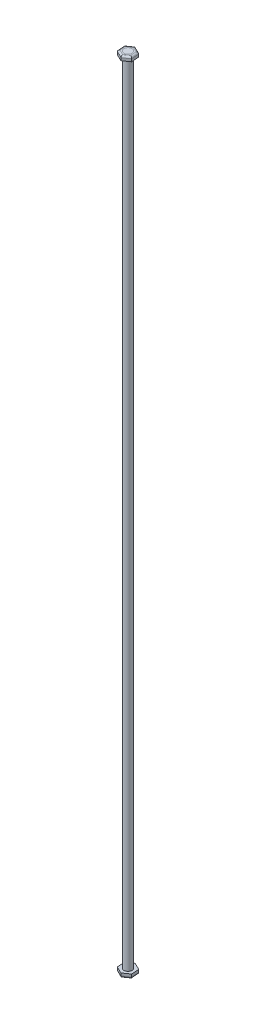
ISO-10303-21;
HEADER;
FILE_DESCRIPTION(('STEP AP214'),'2;1');
FILE_NAME('part.step','',(''),(''),'','','');
FILE_SCHEMA(('AUTOMOTIVE_DESIGN { 1 0 10303 214 1 1 1 1 }'));
ENDSEC;
DATA;
#1=APPLICATION_CONTEXT('core data for automotive mechanical design processes');
#2=APPLICATION_PROTOCOL_DEFINITION('international standard','automotive_design',2000,#1);
#3=PRODUCT_CONTEXT('',#1,'mechanical');
#4=PRODUCT('Part','Part','',(#3));
#5=PRODUCT_RELATED_PRODUCT_CATEGORY('part','',(#4));
#6=PRODUCT_DEFINITION_FORMATION('','',#4);
#7=PRODUCT_DEFINITION_CONTEXT('part definition',#1,'design');
#8=PRODUCT_DEFINITION('design','',#6,#7);
#9=PRODUCT_DEFINITION_SHAPE('','',#8);
#10=(LENGTH_UNIT() NAMED_UNIT(*) SI_UNIT(.MILLI.,.METRE.));
#11=(NAMED_UNIT(*) PLANE_ANGLE_UNIT() SI_UNIT($,.RADIAN.));
#12=(NAMED_UNIT(*) SI_UNIT($,.STERADIAN.) SOLID_ANGLE_UNIT());
#13=UNCERTAINTY_MEASURE_WITH_UNIT(LENGTH_MEASURE(1.E-05),#10,'distance_accuracy_value','');
#14=(GEOMETRIC_REPRESENTATION_CONTEXT(3) GLOBAL_UNCERTAINTY_ASSIGNED_CONTEXT((#13)) GLOBAL_UNIT_ASSIGNED_CONTEXT((#10,
#11,#12)) REPRESENTATION_CONTEXT('',''));
#15=CARTESIAN_POINT('',(0.,0.,0.));
#16=DIRECTION('',(0.,0.,1.));
#17=DIRECTION('',(1.,0.,0.));
#18=AXIS2_PLACEMENT_3D('',#15,#16,#17);
#19=CARTESIAN_POINT('',(0.,236.855,0.));
#20=DIRECTION('',(0.,1.,0.));
#21=DIRECTION('',(0.,0.,1.));
#22=AXIS2_PLACEMENT_3D('',#19,#20,#21);
#23=PLANE('',#22);
#24=CARTESIAN_POINT('',(0.,236.855,0.));
#25=DIRECTION('',(0.,1.,0.));
#26=DIRECTION('',(0.,0.,1.));
#27=AXIS2_PLACEMENT_3D('',#24,#25,#26);
#28=CIRCLE('',#27,2.38125);
#29=CARTESIAN_POINT('',(0.,236.855,2.38125));
#30=VERTEX_POINT('',#29);
#31=EDGE_CURVE('P0_E115',#30,#30,#28,.F.);
#32=ORIENTED_EDGE('',*,*,#31,.T.);
#33=EDGE_LOOP('',(#32));
#34=FACE_BOUND('',#33,.T.);
#35=DIRECTION('',(0.0820841913920924,0.,0.996625398795107));
#36=VECTOR('',#35,1.);
#37=CARTESIAN_POINT('',(-2.95873165267297,236.855,0.243687443195274));
#38=LINE('',#37,#36);
#39=CARTESIAN_POINT('',(-2.81803864174605,236.855,1.95191195932588));
#40=VERTEX_POINT('',#39);
#41=CARTESIAN_POINT('',(-3.0994246635999,236.855,-1.46453707293534));
#42=VERTEX_POINT('',#41);
#43=EDGE_CURVE('P0_E103',#40,#42,#38,.F.);
#44=ORIENTED_EDGE('',*,*,#43,.F.);
#45=DIRECTION('',(0.904145009109406,0.,0.427225704402898));
#46=VECTOR('',#45,1.);
#47=CARTESIAN_POINT('',(-1.2683263099461,236.855,2.68418049579355));
#48=LINE('',#47,#46);
#49=CARTESIAN_POINT('',(0.281386021853847,236.855,3.41644903226122));
#50=VERTEX_POINT('',#49);
#51=EDGE_CURVE('P0_E144',#50,#40,#48,.F.);
#52=ORIENTED_EDGE('',*,*,#51,.F.);
#53=DIRECTION('',(0.822060817717314,0.,-0.569399694392209));
#54=VECTOR('',#53,1.);
#55=CARTESIAN_POINT('',(1.69040534272687,236.855,2.44049305259828));
#56=LINE('',#55,#54);
#57=CARTESIAN_POINT('',(3.0994246635999,236.855,1.46453707293534));
#58=VERTEX_POINT('',#57);
#59=EDGE_CURVE('P0_E140',#58,#50,#56,.F.);
#60=ORIENTED_EDGE('',*,*,#59,.F.);
#61=DIRECTION('',(-0.082084191392092,0.,-0.996625398795107));
#62=VECTOR('',#61,1.);
#63=CARTESIAN_POINT('',(2.95873165267297,236.855,-0.243687443195273));
#64=LINE('',#63,#62);
#65=CARTESIAN_POINT('',(2.81803864174605,236.855,-1.95191195932588));
#66=VERTEX_POINT('',#65);
#67=EDGE_CURVE('P0_E91',#66,#58,#64,.F.);
#68=ORIENTED_EDGE('',*,*,#67,.F.);
#69=DIRECTION('',(-0.904145009109406,0.,-0.427225704402898));
#70=VECTOR('',#69,1.);
#71=CARTESIAN_POINT('',(1.2683263099461,236.855,-2.68418049579355));
#72=LINE('',#71,#70);
#73=CARTESIAN_POINT('',(-0.281386021853847,236.855,-3.41644903226122));
#74=VERTEX_POINT('',#73);
#75=EDGE_CURVE('P0_E85',#74,#66,#72,.F.);
#76=ORIENTED_EDGE('',*,*,#75,.F.);
#77=DIRECTION('',(-0.822060817717314,0.,0.56939969439221));
#78=VECTOR('',#77,1.);
#79=CARTESIAN_POINT('',(-1.69040534272687,236.855,-2.44049305259828));
#80=LINE('',#79,#78);
#81=EDGE_CURVE('P0_E88',#42,#74,#80,.F.);
#82=ORIENTED_EDGE('',*,*,#81,.F.);
#83=EDGE_LOOP('',(#44,#52,#60,#68,#76,#82));
#84=FACE_BOUND('',#83,.T.);
#85=ADVANCED_FACE('P0_F17',(#34,#84),#23,.T.);
#86=CARTESIAN_POINT('',(1.2683263099461,235.855,-2.68418049579355));
#87=DIRECTION('',(-0.904145009109406,0.,-0.427225704402898));
#88=DIRECTION('',(-0.427225704402898,0.,0.904145009109406));
#89=AXIS2_PLACEMENT_3D('',#86,#87,#88);
#90=CYLINDRICAL_SURFACE('',#89,1.);
#91=CARTESIAN_POINT('',(-0.281386021853847,235.855,-3.41644903226122));
#92=DIRECTION('',(-0.996625398795107,0.,0.0820841913920922));
#93=DIRECTION('',(0.0820841913920922,0.,0.996625398795107));
#94=AXIS2_PLACEMENT_3D('',#91,#92,#93);
#95=ELLIPSE('',#94,1.15470053837925,1.);
#96=CARTESIAN_POINT('',(-0.376168681846721,235.855,-4.56725291681236));
#97=VERTEX_POINT('',#96);
#98=EDGE_CURVE('P0_E20',#74,#97,#95,.T.);
#99=ORIENTED_EDGE('',*,*,#98,.F.);
#100=ORIENTED_EDGE('',*,*,#75,.T.);
#101=CARTESIAN_POINT('',(2.81803864174605,235.855,-1.95191195932588));
#102=DIRECTION('',(-0.569399694392209,0.,-0.822060817717314));
#103=DIRECTION('',(0.822060817717314,0.,-0.569399694392209));
#104=AXIS2_PLACEMENT_3D('',#101,#102,#103);
#105=ELLIPSE('',#104,1.15470053837925,1.);
#106=CARTESIAN_POINT('',(3.76727271054472,235.855,-2.60939809299355));
#107=VERTEX_POINT('',#106);
#108=EDGE_CURVE('P0_E109',#107,#66,#105,.F.);
#109=ORIENTED_EDGE('',*,*,#108,.F.);
#110=DIRECTION('',(-0.904145009109406,0.,-0.427225704402898));
#111=VECTOR('',#110,1.);
#112=CARTESIAN_POINT('',(3.76727271054472,235.855,-2.60939809299355));
#113=LINE('',#112,#111);
#114=EDGE_CURVE('P0_E107',#97,#107,#113,.F.);
#115=ORIENTED_EDGE('',*,*,#114,.F.);
#116=EDGE_LOOP('',(#99,#100,#109,#115));
#117=FACE_BOUND('',#116,.T.);
#118=ADVANCED_FACE('P0_F106',(#117),#90,.T.);
#119=CARTESIAN_POINT('',(-1.69040534272687,235.855,-2.44049305259828));
#120=DIRECTION('',(-0.822060817717314,0.,0.56939969439221));
#121=DIRECTION('',(0.56939969439221,0.,0.822060817717314));
#122=AXIS2_PLACEMENT_3D('',#119,#120,#121);
#123=CYLINDRICAL_SURFACE('',#122,1.);
#124=CARTESIAN_POINT('',(-3.0994246635999,235.855,-1.46453707293534));
#125=DIRECTION('',(-0.427225704402898,0.,0.904145009109406));
#126=DIRECTION('',(0.904145009109406,0.,0.427225704402898));
#127=AXIS2_PLACEMENT_3D('',#124,#125,#126);
#128=ELLIPSE('',#127,1.15470053837925,1.);
#129=CARTESIAN_POINT('',(-4.14344139239144,235.855,-1.95785482381882));
#130=VERTEX_POINT('',#129);
#131=EDGE_CURVE('P0_E102',#42,#130,#128,.T.);
#132=ORIENTED_EDGE('',*,*,#131,.F.);
#133=ORIENTED_EDGE('',*,*,#81,.T.);
#134=ORIENTED_EDGE('',*,*,#98,.T.);
#135=DIRECTION('',(-0.822060817717314,0.,0.56939969439221));
#136=VECTOR('',#135,1.);
#137=CARTESIAN_POINT('',(-0.376168681846721,235.855,-4.56725291681236));
#138=LINE('',#137,#136);
#139=EDGE_CURVE('P0_E114',#130,#97,#138,.F.);
#140=ORIENTED_EDGE('',*,*,#139,.F.);
#141=EDGE_LOOP('',(#132,#133,#134,#140));
#142=FACE_BOUND('',#141,.T.);
#143=ADVANCED_FACE('P0_F99',(#142),#123,.T.);
#144=CARTESIAN_POINT('',(-2.95873165267297,235.855,0.243687443195274));
#145=DIRECTION('',(0.0820841913920924,0.,0.996625398795107));
#146=DIRECTION('',(0.996625398795107,0.,-0.0820841913920924));
#147=AXIS2_PLACEMENT_3D('',#144,#145,#146);
#148=CYLINDRICAL_SURFACE('',#147,1.);
#149=ORIENTED_EDGE('',*,*,#131,.T.);
#150=DIRECTION('',(0.0820841913920924,0.,0.996625398795107));
#151=VECTOR('',#150,1.);
#152=CARTESIAN_POINT('',(-4.14344139239144,235.855,-1.95785482381882));
#153=LINE('',#152,#151);
#154=CARTESIAN_POINT('',(-3.76727271054472,235.855,2.60939809299355));
#155=VERTEX_POINT('',#154);
#156=EDGE_CURVE('P0_E124',#155,#130,#153,.F.);
#157=ORIENTED_EDGE('',*,*,#156,.F.);
#158=CARTESIAN_POINT('',(-2.81803864174605,235.855,1.95191195932588));
#159=DIRECTION('',(0.569399694392209,0.,0.822060817717314));
#160=DIRECTION('',(0.822060817717314,0.,-0.569399694392209));
#161=AXIS2_PLACEMENT_3D('',#158,#159,#160);
#162=ELLIPSE('',#161,1.15470053837925,1.);
#163=EDGE_CURVE('P0_E143',#40,#155,#162,.T.);
#164=ORIENTED_EDGE('',*,*,#163,.F.);
#165=ORIENTED_EDGE('',*,*,#43,.T.);
#166=EDGE_LOOP('',(#149,#157,#164,#165));
#167=FACE_BOUND('',#166,.T.);
#168=ADVANCED_FACE('P0_F303',(#167),#148,.T.);
#169=CARTESIAN_POINT('',(-1.2683263099461,235.855,2.68418049579355));
#170=DIRECTION('',(0.904145009109406,0.,0.427225704402898));
#171=DIRECTION('',(0.427225704402898,0.,-0.904145009109406));
#172=AXIS2_PLACEMENT_3D('',#169,#170,#171);
#173=CYLINDRICAL_SURFACE('',#172,1.);
#174=ORIENTED_EDGE('',*,*,#163,.T.);
#175=DIRECTION('',(0.904145009109406,0.,0.427225704402898));
#176=VECTOR('',#175,1.);
#177=CARTESIAN_POINT('',(-3.76727271054472,235.855,2.60939809299355));
#178=LINE('',#177,#176);
#179=CARTESIAN_POINT('',(0.376168681846721,235.855,4.56725291681236));
#180=VERTEX_POINT('',#179);
#181=EDGE_CURVE('P0_E152',#180,#155,#178,.F.);
#182=ORIENTED_EDGE('',*,*,#181,.F.);
#183=CARTESIAN_POINT('',(0.281386021853847,235.855,3.41644903226122));
#184=DIRECTION('',(0.996625398795107,0.,-0.0820841913920923));
#185=DIRECTION('',(-0.0820841913920923,0.,-0.996625398795107));
#186=AXIS2_PLACEMENT_3D('',#183,#184,#185);
#187=ELLIPSE('',#186,1.15470053837925,1.);
#188=EDGE_CURVE('P0_E141',#50,#180,#187,.T.);
#189=ORIENTED_EDGE('',*,*,#188,.F.);
#190=ORIENTED_EDGE('',*,*,#51,.T.);
#191=EDGE_LOOP('',(#174,#182,#189,#190));
#192=FACE_BOUND('',#191,.T.);
#193=ADVANCED_FACE('P0_F295',(#192),#173,.T.);
#194=CARTESIAN_POINT('',(1.69040534272687,235.855,2.44049305259828));
#195=DIRECTION('',(0.822060817717314,0.,-0.569399694392209));
#196=DIRECTION('',(-0.569399694392209,0.,-0.822060817717314));
#197=AXIS2_PLACEMENT_3D('',#194,#195,#196);
#198=CYLINDRICAL_SURFACE('',#197,1.);
#199=CARTESIAN_POINT('',(3.0994246635999,235.855,1.46453707293534));
#200=DIRECTION('',(0.427225704402898,0.,-0.904145009109406));
#201=DIRECTION('',(-0.904145009109406,0.,-0.427225704402898));
#202=AXIS2_PLACEMENT_3D('',#199,#200,#201);
#203=ELLIPSE('',#202,1.15470053837925,1.);
#204=CARTESIAN_POINT('',(4.14344139239144,235.855,1.95785482381882));
#205=VERTEX_POINT('',#204);
#206=EDGE_CURVE('P0_E138',#58,#205,#203,.T.);
#207=ORIENTED_EDGE('',*,*,#206,.F.);
#208=ORIENTED_EDGE('',*,*,#59,.T.);
#209=ORIENTED_EDGE('',*,*,#188,.T.);
#210=DIRECTION('',(0.822060817717314,0.,-0.569399694392209));
#211=VECTOR('',#210,1.);
#212=CARTESIAN_POINT('',(0.376168681846721,235.855,4.56725291681236));
#213=LINE('',#212,#211);
#214=EDGE_CURVE('P0_E162',#205,#180,#213,.F.);
#215=ORIENTED_EDGE('',*,*,#214,.F.);
#216=EDGE_LOOP('',(#207,#208,#209,#215));
#217=FACE_BOUND('',#216,.T.);
#218=ADVANCED_FACE('P0_F196',(#217),#198,.T.);
#219=CARTESIAN_POINT('',(2.95873165267297,235.855,-0.243687443195273));
#220=DIRECTION('',(-0.082084191392092,0.,-0.996625398795107));
#221=DIRECTION('',(-0.996625398795107,0.,0.082084191392092));
#222=AXIS2_PLACEMENT_3D('',#219,#220,#221);
#223=CYLINDRICAL_SURFACE('',#222,1.);
#224=ORIENTED_EDGE('',*,*,#108,.T.);
#225=ORIENTED_EDGE('',*,*,#67,.T.);
#226=ORIENTED_EDGE('',*,*,#206,.T.);
#227=DIRECTION('',(-0.082084191392092,0.,-0.996625398795107));
#228=VECTOR('',#227,1.);
#229=CARTESIAN_POINT('',(4.14344139239144,235.855,1.95785482381881));
#230=LINE('',#229,#228);
#231=EDGE_CURVE('P0_E172',#107,#205,#230,.F.);
#232=ORIENTED_EDGE('',*,*,#231,.F.);
#233=EDGE_LOOP('',(#224,#225,#226,#232));
#234=FACE_BOUND('',#233,.T.);
#235=ADVANCED_FACE('P0_F193',(#234),#223,.T.);
#236=CARTESIAN_POINT('',(0.,234.315,0.));
#237=DIRECTION('',(0.,1.,0.));
#238=DIRECTION('',(0.,0.,1.));
#239=AXIS2_PLACEMENT_3D('',#236,#237,#238);
#240=CYLINDRICAL_SURFACE('',#239,2.38125);
#241=CARTESIAN_POINT('',(0.,234.315,0.));
#242=DIRECTION('',(0.,1.,0.));
#243=DIRECTION('',(0.,0.,1.));
#244=AXIS2_PLACEMENT_3D('',#241,#242,#243);
#245=CIRCLE('',#244,2.38125);
#246=CARTESIAN_POINT('',(0.,234.315,2.38125));
#247=VERTEX_POINT('',#246);
#248=EDGE_CURVE('P0_E132',#247,#247,#245,.F.);
#249=ORIENTED_EDGE('',*,*,#248,.T.);
#250=EDGE_LOOP('',(#249));
#251=FACE_BOUND('',#250,.T.);
#252=ORIENTED_EDGE('',*,*,#31,.F.);
#253=EDGE_LOOP('',(#252));
#254=FACE_BOUND('',#253,.T.);
#255=ADVANCED_FACE('P0_F217',(#251,#254),#240,.F.);
#256=CARTESIAN_POINT('',(3.76727271054472,234.315,-2.60939809299355));
#257=DIRECTION('',(0.427225704402898,0.,-0.904145009109406));
#258=DIRECTION('',(-0.904145009109406,0.,-0.427225704402898));
#259=AXIS2_PLACEMENT_3D('',#256,#257,#258);
#260=PLANE('',#259);
#261=DIRECTION('',(0.,1.,0.));
#262=VECTOR('',#261,1.);
#263=CARTESIAN_POINT('',(3.76727271054472,234.315,-2.60939809299355));
#264=LINE('',#263,#262);
#265=CARTESIAN_POINT('',(3.76727271054472,234.315,-2.60939809299355));
#266=VERTEX_POINT('',#265);
#267=EDGE_CURVE('P0_E167',#266,#107,#264,.T.);
#268=ORIENTED_EDGE('',*,*,#267,.F.);
#269=DIRECTION('',(-0.904145009109406,0.,-0.427225704402898));
#270=VECTOR('',#269,1.);
#271=CARTESIAN_POINT('',(3.76727271054472,234.315,-2.60939809299355));
#272=LINE('',#271,#270);
#273=CARTESIAN_POINT('',(-0.376168681846721,234.315,-4.56725291681236));
#274=VERTEX_POINT('',#273);
#275=EDGE_CURVE('P0_E120',#266,#274,#272,.T.);
#276=ORIENTED_EDGE('',*,*,#275,.T.);
#277=DIRECTION('',(0.,1.,0.));
#278=VECTOR('',#277,1.);
#279=CARTESIAN_POINT('',(-0.376168681846721,234.315,-4.56725291681236));
#280=LINE('',#279,#278);
#281=EDGE_CURVE('P0_E118',#97,#274,#280,.F.);
#282=ORIENTED_EDGE('',*,*,#281,.F.);
#283=ORIENTED_EDGE('',*,*,#114,.T.);
#284=EDGE_LOOP('',(#268,#276,#282,#283));
#285=FACE_BOUND('',#284,.T.);
#286=ADVANCED_FACE('P0_F119',(#285),#260,.T.);
#287=CARTESIAN_POINT('',(-0.376168681846721,234.315,-4.56725291681236));
#288=DIRECTION('',(-0.56939969439221,0.,-0.822060817717314));
#289=DIRECTION('',(-0.822060817717314,0.,0.56939969439221));
#290=AXIS2_PLACEMENT_3D('',#287,#288,#289);
#291=PLANE('',#290);
#292=ORIENTED_EDGE('',*,*,#281,.T.);
#293=DIRECTION('',(-0.822060817717314,0.,0.569399694392209));
#294=VECTOR('',#293,1.);
#295=CARTESIAN_POINT('',(-0.376168681846721,234.315,-4.56725291681236));
#296=LINE('',#295,#294);
#297=CARTESIAN_POINT('',(-4.14344139239144,234.315,-1.95785482381881));
#298=VERTEX_POINT('',#297);
#299=EDGE_CURVE('P0_E181',#274,#298,#296,.T.);
#300=ORIENTED_EDGE('',*,*,#299,.T.);
#301=DIRECTION('',(0.,1.,0.));
#302=VECTOR('',#301,1.);
#303=CARTESIAN_POINT('',(-4.14344139239144,234.315,-1.95785482381882));
#304=LINE('',#303,#302);
#305=EDGE_CURVE('P0_E127',#130,#298,#304,.F.);
#306=ORIENTED_EDGE('',*,*,#305,.F.);
#307=ORIENTED_EDGE('',*,*,#139,.T.);
#308=EDGE_LOOP('',(#292,#300,#306,#307));
#309=FACE_BOUND('',#308,.T.);
#310=ADVANCED_FACE('P0_F208',(#309),#291,.T.);
#311=CARTESIAN_POINT('',(-4.14344139239144,234.315,-1.95785482381882));
#312=DIRECTION('',(-0.996625398795107,0.,0.0820841913920924));
#313=DIRECTION('',(0.0820841913920924,0.,0.996625398795107));
#314=AXIS2_PLACEMENT_3D('',#311,#312,#313);
#315=PLANE('',#314);
#316=ORIENTED_EDGE('',*,*,#305,.T.);
#317=DIRECTION('',(0.0820841913920924,0.,0.996625398795107));
#318=VECTOR('',#317,1.);
#319=CARTESIAN_POINT('',(-4.14344139239144,234.315,-1.95785482381882));
#320=LINE('',#319,#318);
#321=CARTESIAN_POINT('',(-3.76727271054472,234.315,2.60939809299355));
#322=VERTEX_POINT('',#321);
#323=EDGE_CURVE('P0_E184',#298,#322,#320,.T.);
#324=ORIENTED_EDGE('',*,*,#323,.T.);
#325=DIRECTION('',(0.,1.,0.));
#326=VECTOR('',#325,1.);
#327=CARTESIAN_POINT('',(-3.76727271054472,234.315,2.60939809299355));
#328=LINE('',#327,#326);
#329=EDGE_CURVE('P0_E151',#155,#322,#328,.F.);
#330=ORIENTED_EDGE('',*,*,#329,.F.);
#331=ORIENTED_EDGE('',*,*,#156,.T.);
#332=EDGE_LOOP('',(#316,#324,#330,#331));
#333=FACE_BOUND('',#332,.T.);
#334=ADVANCED_FACE('P0_F207',(#333),#315,.T.);
#335=CARTESIAN_POINT('',(-3.76727271054472,234.315,2.60939809299355));
#336=DIRECTION('',(-0.427225704402898,0.,0.904145009109406));
#337=DIRECTION('',(0.904145009109406,0.,0.427225704402898));
#338=AXIS2_PLACEMENT_3D('',#335,#336,#337);
#339=PLANE('',#338);
#340=ORIENTED_EDGE('',*,*,#329,.T.);
#341=DIRECTION('',(0.904145009109406,0.,0.427225704402898));
#342=VECTOR('',#341,1.);
#343=CARTESIAN_POINT('',(-3.76727271054472,234.315,2.60939809299355));
#344=LINE('',#343,#342);
#345=CARTESIAN_POINT('',(0.376168681846721,234.315,4.56725291681236));
#346=VERTEX_POINT('',#345);
#347=EDGE_CURVE('P0_E186',#322,#346,#344,.T.);
#348=ORIENTED_EDGE('',*,*,#347,.T.);
#349=DIRECTION('',(0.,1.,0.));
#350=VECTOR('',#349,1.);
#351=CARTESIAN_POINT('',(0.376168681846721,234.315,4.56725291681236));
#352=LINE('',#351,#350);
#353=EDGE_CURVE('P0_E166',#180,#346,#352,.F.);
#354=ORIENTED_EDGE('',*,*,#353,.F.);
#355=ORIENTED_EDGE('',*,*,#181,.T.);
#356=EDGE_LOOP('',(#340,#348,#354,#355));
#357=FACE_BOUND('',#356,.T.);
#358=ADVANCED_FACE('P0_F203',(#357),#339,.T.);
#359=CARTESIAN_POINT('',(0.376168681846721,234.315,4.56725291681236));
#360=DIRECTION('',(0.569399694392209,0.,0.822060817717314));
#361=DIRECTION('',(0.822060817717314,0.,-0.569399694392209));
#362=AXIS2_PLACEMENT_3D('',#359,#360,#361);
#363=PLANE('',#362);
#364=ORIENTED_EDGE('',*,*,#353,.T.);
#365=DIRECTION('',(0.822060817717314,0.,-0.569399694392209));
#366=VECTOR('',#365,1.);
#367=CARTESIAN_POINT('',(0.376168681846721,234.315,4.56725291681236));
#368=LINE('',#367,#366);
#369=CARTESIAN_POINT('',(4.14344139239144,234.315,1.95785482381881));
#370=VERTEX_POINT('',#369);
#371=EDGE_CURVE('P0_E26',#346,#370,#368,.T.);
#372=ORIENTED_EDGE('',*,*,#371,.T.);
#373=DIRECTION('',(0.,1.,0.));
#374=VECTOR('',#373,1.);
#375=CARTESIAN_POINT('',(4.14344139239144,234.315,1.95785482381881));
#376=LINE('',#375,#374);
#377=EDGE_CURVE('P0_E34',#205,#370,#376,.F.);
#378=ORIENTED_EDGE('',*,*,#377,.F.);
#379=ORIENTED_EDGE('',*,*,#214,.T.);
#380=EDGE_LOOP('',(#364,#372,#378,#379));
#381=FACE_BOUND('',#380,.T.);
#382=ADVANCED_FACE('P0_F198',(#381),#363,.T.);
#383=CARTESIAN_POINT('',(4.14344139239144,234.315,1.95785482381881));
#384=DIRECTION('',(0.996625398795107,0.,-0.082084191392092));
#385=DIRECTION('',(-0.082084191392092,0.,-0.996625398795107));
#386=AXIS2_PLACEMENT_3D('',#383,#384,#385);
#387=PLANE('',#386);
#388=ORIENTED_EDGE('',*,*,#377,.T.);
#389=DIRECTION('',(-0.082084191392092,0.,-0.996625398795107));
#390=VECTOR('',#389,1.);
#391=CARTESIAN_POINT('',(4.14344139239144,234.315,1.95785482381881));
#392=LINE('',#391,#390);
#393=EDGE_CURVE('P0_E11',#370,#266,#392,.T.);
#394=ORIENTED_EDGE('',*,*,#393,.T.);
#395=ORIENTED_EDGE('',*,*,#267,.T.);
#396=ORIENTED_EDGE('',*,*,#231,.T.);
#397=EDGE_LOOP('',(#388,#394,#395,#396));
#398=FACE_BOUND('',#397,.T.);
#399=ADVANCED_FACE('P0_F220',(#398),#387,.T.);
#400=CARTESIAN_POINT('',(0.,234.315,0.));
#401=DIRECTION('',(0.,1.,0.));
#402=DIRECTION('',(0.,0.,1.));
#403=AXIS2_PLACEMENT_3D('',#400,#401,#402);
#404=PLANE('',#403);
#405=ORIENTED_EDGE('',*,*,#371,.F.);
#406=ORIENTED_EDGE('',*,*,#347,.F.);
#407=ORIENTED_EDGE('',*,*,#323,.F.);
#408=ORIENTED_EDGE('',*,*,#299,.F.);
#409=ORIENTED_EDGE('',*,*,#275,.F.);
#410=ORIENTED_EDGE('',*,*,#393,.F.);
#411=EDGE_LOOP('',(#405,#406,#407,#408,#409,#410));
#412=FACE_BOUND('',#411,.T.);
#413=ORIENTED_EDGE('',*,*,#248,.F.);
#414=EDGE_LOOP('',(#413));
#415=FACE_BOUND('',#414,.T.);
#416=ADVANCED_FACE('P0_F205',(#412,#415),#404,.F.);
#417=CLOSED_SHELL('',(#85,#118,#143,#168,#193,#218,#235,#255,#286,#310,#334,#358,#382,#399,#416));
#418=MANIFOLD_SOLID_BREP('P0_B1',#417);
#419=CARTESIAN_POINT('',(0.,236.855,0.));
#420=DIRECTION('',(0.,1.,0.));
#421=DIRECTION('',(0.,0.,1.));
#422=AXIS2_PLACEMENT_3D('',#419,#420,#421);
#423=PLANE('',#422);
#424=CARTESIAN_POINT('',(0.,236.855,0.));
#425=DIRECTION('',(0.,-1.,0.));
#426=DIRECTION('',(0.,0.,-1.));
#427=AXIS2_PLACEMENT_3D('',#424,#425,#426);
#428=CIRCLE('',#427,2.38125);
#429=CARTESIAN_POINT('',(0.,236.855,-2.38125));
#430=VERTEX_POINT('',#429);
#431=EDGE_CURVE('P1_E18',#430,#430,#428,.T.);
#432=ORIENTED_EDGE('',*,*,#431,.F.);
#433=EDGE_LOOP('',(#432));
#434=FACE_BOUND('',#433,.T.);
#435=ADVANCED_FACE('P1_F15',(#434),#423,.T.);
#436=CARTESIAN_POINT('',(0.,-236.855,0.));
#437=DIRECTION('',(0.,1.,0.));
#438=DIRECTION('',(0.,0.,1.));
#439=AXIS2_PLACEMENT_3D('',#436,#437,#438);
#440=PLANE('',#439);
#441=CARTESIAN_POINT('',(0.,-236.855,0.));
#442=DIRECTION('',(0.,-1.,0.));
#443=DIRECTION('',(0.,0.,-1.));
#444=AXIS2_PLACEMENT_3D('',#441,#442,#443);
#445=CIRCLE('',#444,2.38125);
#446=CARTESIAN_POINT('',(0.,-236.855,-2.38125));
#447=VERTEX_POINT('',#446);
#448=EDGE_CURVE('P1_E10',#447,#447,#445,.F.);
#449=ORIENTED_EDGE('',*,*,#448,.F.);
#450=EDGE_LOOP('',(#449));
#451=FACE_BOUND('',#450,.T.);
#452=ADVANCED_FACE('P1_F30',(#451),#440,.F.);
#453=CARTESIAN_POINT('',(0.,236.855,0.));
#454=DIRECTION('',(0.,-1.,0.));
#455=DIRECTION('',(0.,0.,-1.));
#456=AXIS2_PLACEMENT_3D('',#453,#454,#455);
#457=CYLINDRICAL_SURFACE('',#456,2.38125);
#458=ORIENTED_EDGE('',*,*,#448,.T.);
#459=EDGE_LOOP('',(#458));
#460=FACE_BOUND('',#459,.T.);
#461=ORIENTED_EDGE('',*,*,#431,.T.);
#462=EDGE_LOOP('',(#461));
#463=FACE_BOUND('',#462,.T.);
#464=ADVANCED_FACE('P1_F27',(#460,#463),#457,.T.);
#465=CLOSED_SHELL('',(#435,#452,#464));
#466=MANIFOLD_SOLID_BREP('P1_B1',#465);
#467=CARTESIAN_POINT('',(0.,-236.855,0.));
#468=DIRECTION('',(0.,-1.,0.));
#469=DIRECTION('',(0.,0.,-1.));
#470=AXIS2_PLACEMENT_3D('',#467,#468,#469);
#471=PLANE('',#470);
#472=CARTESIAN_POINT('',(0.,-236.855,0.));
#473=DIRECTION('',(0.,-1.,0.));
#474=DIRECTION('',(0.,0.,-1.));
#475=AXIS2_PLACEMENT_3D('',#472,#473,#474);
#476=CIRCLE('',#475,2.38125);
#477=CARTESIAN_POINT('',(0.,-236.855,-2.38125));
#478=VERTEX_POINT('',#477);
#479=EDGE_CURVE('P2_E137',#478,#478,#476,.F.);
#480=ORIENTED_EDGE('',*,*,#479,.T.);
#481=EDGE_LOOP('',(#480));
#482=FACE_BOUND('',#481,.T.);
#483=DIRECTION('',(-0.904145009109406,0.,-0.427225704402898));
#484=VECTOR('',#483,1.);
#485=CARTESIAN_POINT('',(1.2683263099461,-236.855,-2.68418049579355));
#486=LINE('',#485,#484);
#487=CARTESIAN_POINT('',(2.81803864174605,-236.855,-1.95191195932588));
#488=VERTEX_POINT('',#487);
#489=CARTESIAN_POINT('',(-0.281386021853847,-236.855,-3.41644903226122));
#490=VERTEX_POINT('',#489);
#491=EDGE_CURVE('P2_E123',#488,#490,#486,.T.);
#492=ORIENTED_EDGE('',*,*,#491,.F.);
#493=DIRECTION('',(-0.082084191392092,0.,-0.996625398795107));
#494=VECTOR('',#493,1.);
#495=CARTESIAN_POINT('',(2.95873165267297,-236.855,-0.243687443195273));
#496=LINE('',#495,#494);
#497=CARTESIAN_POINT('',(3.0994246635999,-236.855,1.46453707293534));
#498=VERTEX_POINT('',#497);
#499=EDGE_CURVE('P2_E90',#498,#488,#496,.T.);
#500=ORIENTED_EDGE('',*,*,#499,.F.);
#501=DIRECTION('',(0.822060817717314,0.,-0.569399694392209));
#502=VECTOR('',#501,1.);
#503=CARTESIAN_POINT('',(1.69040534272687,-236.855,2.44049305259828));
#504=LINE('',#503,#502);
#505=CARTESIAN_POINT('',(0.281386021853847,-236.855,3.41644903226122));
#506=VERTEX_POINT('',#505);
#507=EDGE_CURVE('P2_E84',#506,#498,#504,.T.);
#508=ORIENTED_EDGE('',*,*,#507,.F.);
#509=DIRECTION('',(0.904145009109406,0.,0.427225704402898));
#510=VECTOR('',#509,1.);
#511=CARTESIAN_POINT('',(-1.2683263099461,-236.855,2.68418049579355));
#512=LINE('',#511,#510);
#513=CARTESIAN_POINT('',(-2.81803864174605,-236.855,1.95191195932588));
#514=VERTEX_POINT('',#513);
#515=EDGE_CURVE('P2_E88',#514,#506,#512,.T.);
#516=ORIENTED_EDGE('',*,*,#515,.F.);
#517=DIRECTION('',(0.0820841913920924,0.,0.996625398795107));
#518=VECTOR('',#517,1.);
#519=CARTESIAN_POINT('',(-2.95873165267297,-236.855,0.243687443195274));
#520=LINE('',#519,#518);
#521=CARTESIAN_POINT('',(-3.0994246635999,-236.855,-1.46453707293534));
#522=VERTEX_POINT('',#521);
#523=EDGE_CURVE('P2_E115',#522,#514,#520,.T.);
#524=ORIENTED_EDGE('',*,*,#523,.F.);
#525=DIRECTION('',(-0.822060817717314,0.,0.56939969439221));
#526=VECTOR('',#525,1.);
#527=CARTESIAN_POINT('',(-1.69040534272687,-236.855,-2.44049305259828));
#528=LINE('',#527,#526);
#529=EDGE_CURVE('P2_E117',#490,#522,#528,.T.);
#530=ORIENTED_EDGE('',*,*,#529,.F.);
#531=EDGE_LOOP('',(#492,#500,#508,#516,#524,#530));
#532=FACE_BOUND('',#531,.T.);
#533=ADVANCED_FACE('P2_F17',(#482,#532),#471,.T.);
#534=CARTESIAN_POINT('',(1.69040534272687,-235.855,2.44049305259828));
#535=DIRECTION('',(0.822060817717314,0.,-0.569399694392209));
#536=DIRECTION('',(-0.569399694392209,0.,-0.822060817717314));
#537=AXIS2_PLACEMENT_3D('',#534,#535,#536);
#538=CYLINDRICAL_SURFACE('',#537,1.);
#539=CARTESIAN_POINT('',(3.0994246635999,-235.855,1.46453707293534));
#540=DIRECTION('',(0.427225704402898,0.,-0.904145009109406));
#541=DIRECTION('',(-0.904145009109406,0.,-0.427225704402898));
#542=AXIS2_PLACEMENT_3D('',#539,#540,#541);
#543=ELLIPSE('',#542,1.15470053837925,1.);
#544=CARTESIAN_POINT('',(4.14344139239144,-235.855,1.95785482381882));
#545=VERTEX_POINT('',#544);
#546=EDGE_CURVE('P2_E129',#545,#498,#543,.T.);
#547=ORIENTED_EDGE('',*,*,#546,.F.);
#548=DIRECTION('',(0.822060817717314,0.,-0.569399694392209));
#549=VECTOR('',#548,1.);
#550=CARTESIAN_POINT('',(0.376168681846721,-235.855,4.56725291681236));
#551=LINE('',#550,#549);
#552=CARTESIAN_POINT('',(0.37616868184672,-235.855,4.56725291681236));
#553=VERTEX_POINT('',#552);
#554=EDGE_CURVE('P2_E107',#553,#545,#551,.T.);
#555=ORIENTED_EDGE('',*,*,#554,.F.);
#556=CARTESIAN_POINT('',(0.281386021853846,-235.855,3.41644903226122));
#557=DIRECTION('',(0.996625398795107,0.,-0.0820841913920923));
#558=DIRECTION('',(0.0820841913920923,0.,0.996625398795107));
#559=AXIS2_PLACEMENT_3D('',#556,#557,#558);
#560=ELLIPSE('',#559,1.15470053837925,1.);
#561=EDGE_CURVE('P2_E20',#506,#553,#560,.F.);
#562=ORIENTED_EDGE('',*,*,#561,.F.);
#563=ORIENTED_EDGE('',*,*,#507,.T.);
#564=EDGE_LOOP('',(#547,#555,#562,#563));
#565=FACE_BOUND('',#564,.T.);
#566=ADVANCED_FACE('P2_F106',(#565),#538,.T.);
#567=CARTESIAN_POINT('',(-1.2683263099461,-235.855,2.68418049579355));
#568=DIRECTION('',(0.904145009109406,0.,0.427225704402898));
#569=DIRECTION('',(0.427225704402898,0.,-0.904145009109406));
#570=AXIS2_PLACEMENT_3D('',#567,#568,#569);
#571=CYLINDRICAL_SURFACE('',#570,1.);
#572=CARTESIAN_POINT('',(-2.81803864174605,-235.855,1.95191195932588));
#573=DIRECTION('',(0.569399694392209,0.,0.822060817717314));
#574=DIRECTION('',(-0.822060817717314,0.,0.569399694392209));
#575=AXIS2_PLACEMENT_3D('',#572,#573,#574);
#576=ELLIPSE('',#575,1.15470053837925,1.);
#577=CARTESIAN_POINT('',(-3.76727271054472,-235.855,2.60939809299355));
#578=VERTEX_POINT('',#577);
#579=EDGE_CURVE('P2_E103',#514,#578,#576,.F.);
#580=ORIENTED_EDGE('',*,*,#579,.F.);
#581=ORIENTED_EDGE('',*,*,#515,.T.);
#582=ORIENTED_EDGE('',*,*,#561,.T.);
#583=DIRECTION('',(0.904145009109406,0.,0.427225704402898));
#584=VECTOR('',#583,1.);
#585=CARTESIAN_POINT('',(-3.76727271054472,-235.855,2.60939809299355));
#586=LINE('',#585,#584);
#587=EDGE_CURVE('P2_E146',#578,#553,#586,.T.);
#588=ORIENTED_EDGE('',*,*,#587,.F.);
#589=EDGE_LOOP('',(#580,#581,#582,#588));
#590=FACE_BOUND('',#589,.T.);
#591=ADVANCED_FACE('P2_F100',(#590),#571,.T.);
#592=CARTESIAN_POINT('',(-2.95873165267297,-235.855,0.243687443195274));
#593=DIRECTION('',(0.0820841913920924,0.,0.996625398795107));
#594=DIRECTION('',(0.996625398795107,0.,-0.0820841913920924));
#595=AXIS2_PLACEMENT_3D('',#592,#593,#594);
#596=CYLINDRICAL_SURFACE('',#595,1.);
#597=CARTESIAN_POINT('',(-3.0994246635999,-235.855,-1.46453707293534));
#598=DIRECTION('',(-0.427225704402898,0.,0.904145009109406));
#599=DIRECTION('',(-0.904145009109406,0.,-0.427225704402898));
#600=AXIS2_PLACEMENT_3D('',#597,#598,#599);
#601=ELLIPSE('',#600,1.15470053837925,1.);
#602=CARTESIAN_POINT('',(-4.14344139239144,-235.855,-1.95785482381882));
#603=VERTEX_POINT('',#602);
#604=EDGE_CURVE('P2_E120',#522,#603,#601,.F.);
#605=ORIENTED_EDGE('',*,*,#604,.F.);
#606=ORIENTED_EDGE('',*,*,#523,.T.);
#607=ORIENTED_EDGE('',*,*,#579,.T.);
#608=DIRECTION('',(0.0820841913920924,0.,0.996625398795107));
#609=VECTOR('',#608,1.);
#610=CARTESIAN_POINT('',(-4.14344139239144,-235.855,-1.95785482381882));
#611=LINE('',#610,#609);
#612=EDGE_CURVE('P2_E152',#603,#578,#611,.T.);
#613=ORIENTED_EDGE('',*,*,#612,.F.);
#614=EDGE_LOOP('',(#605,#606,#607,#613));
#615=FACE_BOUND('',#614,.T.);
#616=ADVANCED_FACE('P2_F285',(#615),#596,.T.);
#617=CARTESIAN_POINT('',(-1.69040534272687,-235.855,-2.44049305259828));
#618=DIRECTION('',(-0.822060817717314,0.,0.56939969439221));
#619=DIRECTION('',(0.56939969439221,0.,0.822060817717314));
#620=AXIS2_PLACEMENT_3D('',#617,#618,#619);
#621=CYLINDRICAL_SURFACE('',#620,1.);
#622=ORIENTED_EDGE('',*,*,#604,.T.);
#623=DIRECTION('',(-0.822060817717314,0.,0.56939969439221));
#624=VECTOR('',#623,1.);
#625=CARTESIAN_POINT('',(-0.376168681846721,-235.855,-4.56725291681236));
#626=LINE('',#625,#624);
#627=CARTESIAN_POINT('',(-0.376168681846721,-235.855,-4.56725291681236));
#628=VERTEX_POINT('',#627);
#629=EDGE_CURVE('P2_E159',#628,#603,#626,.T.);
#630=ORIENTED_EDGE('',*,*,#629,.F.);
#631=CARTESIAN_POINT('',(-0.281386021853847,-235.855,-3.41644903226122));
#632=DIRECTION('',(-0.996625398795107,0.,0.0820841913920922));
#633=DIRECTION('',(-0.0820841913920922,0.,-0.996625398795107));
#634=AXIS2_PLACEMENT_3D('',#631,#632,#633);
#635=ELLIPSE('',#634,1.15470053837925,1.);
#636=EDGE_CURVE('P2_E126',#490,#628,#635,.F.);
#637=ORIENTED_EDGE('',*,*,#636,.F.);
#638=ORIENTED_EDGE('',*,*,#529,.T.);
#639=EDGE_LOOP('',(#622,#630,#637,#638));
#640=FACE_BOUND('',#639,.T.);
#641=ADVANCED_FACE('P2_F281',(#640),#621,.T.);
#642=CARTESIAN_POINT('',(1.2683263099461,-235.855,-2.68418049579355));
#643=DIRECTION('',(-0.904145009109406,0.,-0.427225704402898));
#644=DIRECTION('',(-0.427225704402898,0.,0.904145009109406));
#645=AXIS2_PLACEMENT_3D('',#642,#643,#644);
#646=CYLINDRICAL_SURFACE('',#645,1.);
#647=ORIENTED_EDGE('',*,*,#636,.T.);
#648=DIRECTION('',(-0.904145009109406,0.,-0.427225704402898));
#649=VECTOR('',#648,1.);
#650=CARTESIAN_POINT('',(3.76727271054472,-235.855,-2.60939809299355));
#651=LINE('',#650,#649);
#652=CARTESIAN_POINT('',(3.76727271054472,-235.855,-2.60939809299355));
#653=VERTEX_POINT('',#652);
#654=EDGE_CURVE('P2_E166',#653,#628,#651,.T.);
#655=ORIENTED_EDGE('',*,*,#654,.F.);
#656=CARTESIAN_POINT('',(2.81803864174605,-235.855,-1.95191195932588));
#657=DIRECTION('',(-0.569399694392209,0.,-0.822060817717314));
#658=DIRECTION('',(0.822060817717314,0.,-0.569399694392209));
#659=AXIS2_PLACEMENT_3D('',#656,#657,#658);
#660=ELLIPSE('',#659,1.15470053837925,1.);
#661=EDGE_CURVE('P2_E134',#488,#653,#660,.F.);
#662=ORIENTED_EDGE('',*,*,#661,.F.);
#663=ORIENTED_EDGE('',*,*,#491,.T.);
#664=EDGE_LOOP('',(#647,#655,#662,#663));
#665=FACE_BOUND('',#664,.T.);
#666=ADVANCED_FACE('P2_F277',(#665),#646,.T.);
#667=CARTESIAN_POINT('',(2.95873165267297,-235.855,-0.243687443195273));
#668=DIRECTION('',(-0.082084191392092,0.,-0.996625398795107));
#669=DIRECTION('',(-0.996625398795107,0.,0.082084191392092));
#670=AXIS2_PLACEMENT_3D('',#667,#668,#669);
#671=CYLINDRICAL_SURFACE('',#670,1.);
#672=ORIENTED_EDGE('',*,*,#661,.T.);
#673=DIRECTION('',(-0.082084191392092,0.,-0.996625398795107));
#674=VECTOR('',#673,1.);
#675=CARTESIAN_POINT('',(4.14344139239144,-235.855,1.95785482381881));
#676=LINE('',#675,#674);
#677=EDGE_CURVE('P2_E176',#545,#653,#676,.T.);
#678=ORIENTED_EDGE('',*,*,#677,.F.);
#679=ORIENTED_EDGE('',*,*,#546,.T.);
#680=ORIENTED_EDGE('',*,*,#499,.T.);
#681=EDGE_LOOP('',(#672,#678,#679,#680));
#682=FACE_BOUND('',#681,.T.);
#683=ADVANCED_FACE('P2_F273',(#682),#671,.T.);
#684=CARTESIAN_POINT('',(0.,-234.315,0.));
#685=DIRECTION('',(0.,-1.,0.));
#686=DIRECTION('',(0.,0.,-1.));
#687=AXIS2_PLACEMENT_3D('',#684,#685,#686);
#688=CYLINDRICAL_SURFACE('',#687,2.38125);
#689=ORIENTED_EDGE('',*,*,#479,.F.);
#690=EDGE_LOOP('',(#689));
#691=FACE_BOUND('',#690,.T.);
#692=CARTESIAN_POINT('',(0.,-234.315,0.));
#693=DIRECTION('',(0.,-1.,0.));
#694=DIRECTION('',(0.,0.,-1.));
#695=AXIS2_PLACEMENT_3D('',#692,#693,#694);
#696=CIRCLE('',#695,2.38125);
#697=CARTESIAN_POINT('',(0.,-234.315,-2.38125));
#698=VERTEX_POINT('',#697);
#699=EDGE_CURVE('P2_E179',#698,#698,#696,.F.);
#700=ORIENTED_EDGE('',*,*,#699,.T.);
#701=EDGE_LOOP('',(#700));
#702=FACE_BOUND('',#701,.T.);
#703=ADVANCED_FACE('P2_F270',(#691,#702),#688,.F.);
#704=CARTESIAN_POINT('',(0.376168681846721,-234.315,4.56725291681236));
#705=DIRECTION('',(0.569399694392209,0.,0.822060817717314));
#706=DIRECTION('',(0.822060817717314,0.,-0.569399694392209));
#707=AXIS2_PLACEMENT_3D('',#704,#705,#706);
#708=PLANE('',#707);
#709=DIRECTION('',(0.,1.,0.));
#710=VECTOR('',#709,1.);
#711=CARTESIAN_POINT('',(0.376168681846721,-234.315,4.56725291681236));
#712=LINE('',#711,#710);
#713=CARTESIAN_POINT('',(0.376168681846721,-234.315,4.56725291681236));
#714=VERTEX_POINT('',#713);
#715=EDGE_CURVE('P2_E143',#553,#714,#712,.T.);
#716=ORIENTED_EDGE('',*,*,#715,.F.);
#717=ORIENTED_EDGE('',*,*,#554,.T.);
#718=DIRECTION('',(0.,1.,0.));
#719=VECTOR('',#718,1.);
#720=CARTESIAN_POINT('',(4.14344139239144,-234.315,1.95785482381881));
#721=LINE('',#720,#719);
#722=CARTESIAN_POINT('',(4.14344139239144,-234.315,1.95785482381881));
#723=VERTEX_POINT('',#722);
#724=EDGE_CURVE('P2_E172',#723,#545,#721,.F.);
#725=ORIENTED_EDGE('',*,*,#724,.F.);
#726=DIRECTION('',(-0.822060817717314,0.,0.569399694392209));
#727=VECTOR('',#726,1.);
#728=CARTESIAN_POINT('',(4.14344139239144,-234.315,1.95785482381881));
#729=LINE('',#728,#727);
#730=EDGE_CURVE('P2_E183',#723,#714,#729,.T.);
#731=ORIENTED_EDGE('',*,*,#730,.T.);
#732=EDGE_LOOP('',(#716,#717,#725,#731));
#733=FACE_BOUND('',#732,.T.);
#734=ADVANCED_FACE('P2_F249',(#733),#708,.T.);
#735=CARTESIAN_POINT('',(-3.76727271054472,-234.315,2.60939809299355));
#736=DIRECTION('',(-0.427225704402898,0.,0.904145009109406));
#737=DIRECTION('',(0.904145009109406,0.,0.427225704402898));
#738=AXIS2_PLACEMENT_3D('',#735,#736,#737);
#739=PLANE('',#738);
#740=DIRECTION('',(0.,1.,0.));
#741=VECTOR('',#740,1.);
#742=CARTESIAN_POINT('',(-3.76727271054472,-234.315,2.60939809299355));
#743=LINE('',#742,#741);
#744=CARTESIAN_POINT('',(-3.76727271054472,-234.315,2.60939809299355));
#745=VERTEX_POINT('',#744);
#746=EDGE_CURVE('P2_E149',#578,#745,#743,.T.);
#747=ORIENTED_EDGE('',*,*,#746,.F.);
#748=ORIENTED_EDGE('',*,*,#587,.T.);
#749=ORIENTED_EDGE('',*,*,#715,.T.);
#750=DIRECTION('',(-0.904145009109406,0.,-0.427225704402898));
#751=VECTOR('',#750,1.);
#752=CARTESIAN_POINT('',(0.376168681846721,-234.315,4.56725291681236));
#753=LINE('',#752,#751);
#754=EDGE_CURVE('P2_E187',#714,#745,#753,.T.);
#755=ORIENTED_EDGE('',*,*,#754,.T.);
#756=EDGE_LOOP('',(#747,#748,#749,#755));
#757=FACE_BOUND('',#756,.T.);
#758=ADVANCED_FACE('P2_F246',(#757),#739,.T.);
#759=CARTESIAN_POINT('',(-4.14344139239144,-234.315,-1.95785482381882));
#760=DIRECTION('',(-0.996625398795107,0.,0.0820841913920924));
#761=DIRECTION('',(0.0820841913920924,0.,0.996625398795107));
#762=AXIS2_PLACEMENT_3D('',#759,#760,#761);
#763=PLANE('',#762);
#764=DIRECTION('',(0.,1.,0.));
#765=VECTOR('',#764,1.);
#766=CARTESIAN_POINT('',(-4.14344139239144,-234.315,-1.95785482381881));
#767=LINE('',#766,#765);
#768=CARTESIAN_POINT('',(-4.14344139239144,-234.315,-1.95785482381882));
#769=VERTEX_POINT('',#768);
#770=EDGE_CURVE('P2_E156',#603,#769,#767,.T.);
#771=ORIENTED_EDGE('',*,*,#770,.F.);
#772=ORIENTED_EDGE('',*,*,#612,.T.);
#773=ORIENTED_EDGE('',*,*,#746,.T.);
#774=DIRECTION('',(-0.0820841913920924,0.,-0.996625398795107));
#775=VECTOR('',#774,1.);
#776=CARTESIAN_POINT('',(-3.76727271054472,-234.315,2.60939809299355));
#777=LINE('',#776,#775);
#778=EDGE_CURVE('P2_E191',#745,#769,#777,.T.);
#779=ORIENTED_EDGE('',*,*,#778,.T.);
#780=EDGE_LOOP('',(#771,#772,#773,#779));
#781=FACE_BOUND('',#780,.T.);
#782=ADVANCED_FACE('P2_F241',(#781),#763,.T.);
#783=CARTESIAN_POINT('',(-0.376168681846721,-234.315,-4.56725291681236));
#784=DIRECTION('',(-0.56939969439221,0.,-0.822060817717314));
#785=DIRECTION('',(-0.822060817717314,0.,0.56939969439221));
#786=AXIS2_PLACEMENT_3D('',#783,#784,#785);
#787=PLANE('',#786);
#788=DIRECTION('',(0.,1.,0.));
#789=VECTOR('',#788,1.);
#790=CARTESIAN_POINT('',(-0.376168681846721,-234.315,-4.56725291681236));
#791=LINE('',#790,#789);
#792=CARTESIAN_POINT('',(-0.376168681846721,-234.315,-4.56725291681236));
#793=VERTEX_POINT('',#792);
#794=EDGE_CURVE('P2_E163',#628,#793,#791,.T.);
#795=ORIENTED_EDGE('',*,*,#794,.F.);
#796=ORIENTED_EDGE('',*,*,#629,.T.);
#797=ORIENTED_EDGE('',*,*,#770,.T.);
#798=DIRECTION('',(0.822060817717314,0.,-0.569399694392209));
#799=VECTOR('',#798,1.);
#800=CARTESIAN_POINT('',(-4.14344139239144,-234.315,-1.95785482381882));
#801=LINE('',#800,#799);
#802=EDGE_CURVE('P2_E195',#769,#793,#801,.T.);
#803=ORIENTED_EDGE('',*,*,#802,.T.);
#804=EDGE_LOOP('',(#795,#796,#797,#803));
#805=FACE_BOUND('',#804,.T.);
#806=ADVANCED_FACE('P2_F237',(#805),#787,.T.);
#807=CARTESIAN_POINT('',(3.76727271054472,-234.315,-2.60939809299355));
#808=DIRECTION('',(0.427225704402898,0.,-0.904145009109406));
#809=DIRECTION('',(-0.904145009109406,0.,-0.427225704402898));
#810=AXIS2_PLACEMENT_3D('',#807,#808,#809);
#811=PLANE('',#810);
#812=DIRECTION('',(0.,1.,0.));
#813=VECTOR('',#812,1.);
#814=CARTESIAN_POINT('',(3.76727271054472,-234.315,-2.60939809299355));
#815=LINE('',#814,#813);
#816=CARTESIAN_POINT('',(3.76727271054472,-234.315,-2.60939809299355));
#817=VERTEX_POINT('',#816);
#818=EDGE_CURVE('P2_E35',#653,#817,#815,.T.);
#819=ORIENTED_EDGE('',*,*,#818,.F.);
#820=ORIENTED_EDGE('',*,*,#654,.T.);
#821=ORIENTED_EDGE('',*,*,#794,.T.);
#822=DIRECTION('',(0.904145009109406,0.,0.427225704402898));
#823=VECTOR('',#822,1.);
#824=CARTESIAN_POINT('',(-0.376168681846721,-234.315,-4.56725291681236));
#825=LINE('',#824,#823);
#826=EDGE_CURVE('P2_E27',#793,#817,#825,.T.);
#827=ORIENTED_EDGE('',*,*,#826,.T.);
#828=EDGE_LOOP('',(#819,#820,#821,#827));
#829=FACE_BOUND('',#828,.T.);
#830=ADVANCED_FACE('P2_F228',(#829),#811,.T.);
#831=CARTESIAN_POINT('',(4.14344139239144,-234.315,1.95785482381881));
#832=DIRECTION('',(0.996625398795107,0.,-0.082084191392092));
#833=DIRECTION('',(-0.082084191392092,0.,-0.996625398795107));
#834=AXIS2_PLACEMENT_3D('',#831,#832,#833);
#835=PLANE('',#834);
#836=ORIENTED_EDGE('',*,*,#724,.T.);
#837=ORIENTED_EDGE('',*,*,#677,.T.);
#838=ORIENTED_EDGE('',*,*,#818,.T.);
#839=DIRECTION('',(0.082084191392092,0.,0.996625398795107));
#840=VECTOR('',#839,1.);
#841=CARTESIAN_POINT('',(3.76727271054472,-234.315,-2.60939809299355));
#842=LINE('',#841,#840);
#843=EDGE_CURVE('P2_E11',#817,#723,#842,.T.);
#844=ORIENTED_EDGE('',*,*,#843,.T.);
#845=EDGE_LOOP('',(#836,#837,#838,#844));
#846=FACE_BOUND('',#845,.T.);
#847=ADVANCED_FACE('P2_F251',(#846),#835,.T.);
#848=CARTESIAN_POINT('',(0.,-234.315,0.));
#849=DIRECTION('',(0.,-1.,0.));
#850=DIRECTION('',(0.,0.,-1.));
#851=AXIS2_PLACEMENT_3D('',#848,#849,#850);
#852=PLANE('',#851);
#853=ORIENTED_EDGE('',*,*,#826,.F.);
#854=ORIENTED_EDGE('',*,*,#802,.F.);
#855=ORIENTED_EDGE('',*,*,#778,.F.);
#856=ORIENTED_EDGE('',*,*,#754,.F.);
#857=ORIENTED_EDGE('',*,*,#730,.F.);
#858=ORIENTED_EDGE('',*,*,#843,.F.);
#859=EDGE_LOOP('',(#853,#854,#855,#856,#857,#858));
#860=FACE_BOUND('',#859,.T.);
#861=ORIENTED_EDGE('',*,*,#699,.F.);
#862=EDGE_LOOP('',(#861));
#863=FACE_BOUND('',#862,.T.);
#864=ADVANCED_FACE('P2_F232',(#860,#863),#852,.F.);
#865=CLOSED_SHELL('',(#533,#566,#591,#616,#641,#666,#683,#703,#734,#758,#782,#806,#830,#847,#864));
#866=MANIFOLD_SOLID_BREP('P2_B1',#865);
#867=ADVANCED_BREP_SHAPE_REPRESENTATION('',(#18,#418,#466,#866),#14);
#868=SHAPE_DEFINITION_REPRESENTATION(#9,#867);
ENDSEC;
END-ISO-10303-21;
